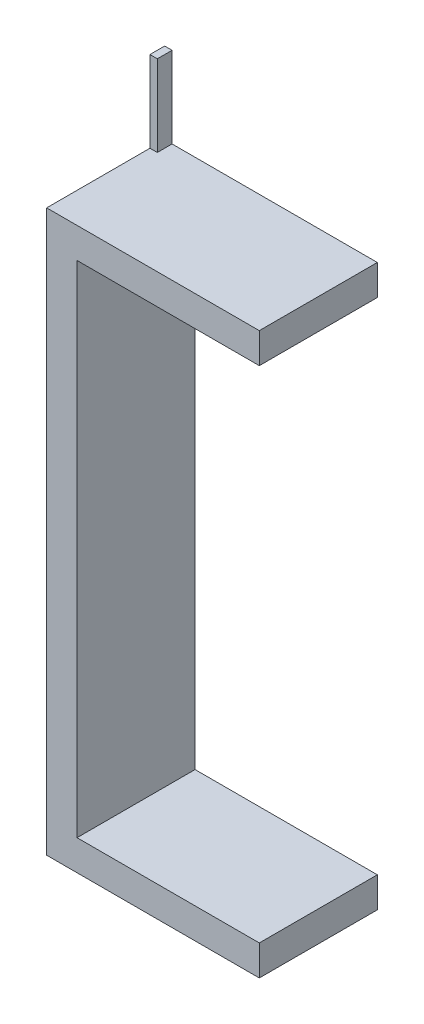
ISO-10303-21;
HEADER;
FILE_DESCRIPTION(('STEP AP214'),'2;1');
FILE_NAME('part.step','',(''),(''),'','','');
FILE_SCHEMA(('AUTOMOTIVE_DESIGN { 1 0 10303 214 1 1 1 1 }'));
ENDSEC;
DATA;
#1=APPLICATION_CONTEXT('core data for automotive mechanical design processes');
#2=APPLICATION_PROTOCOL_DEFINITION('international standard','automotive_design',2000,#1);
#3=PRODUCT_CONTEXT('',#1,'mechanical');
#4=PRODUCT('Part','Part','',(#3));
#5=PRODUCT_RELATED_PRODUCT_CATEGORY('part','',(#4));
#6=PRODUCT_DEFINITION_FORMATION('','',#4);
#7=PRODUCT_DEFINITION_CONTEXT('part definition',#1,'design');
#8=PRODUCT_DEFINITION('design','',#6,#7);
#9=PRODUCT_DEFINITION_SHAPE('','',#8);
#10=(LENGTH_UNIT() NAMED_UNIT(*) SI_UNIT(.MILLI.,.METRE.));
#11=(NAMED_UNIT(*) PLANE_ANGLE_UNIT() SI_UNIT($,.RADIAN.));
#12=(NAMED_UNIT(*) SI_UNIT($,.STERADIAN.) SOLID_ANGLE_UNIT());
#13=UNCERTAINTY_MEASURE_WITH_UNIT(LENGTH_MEASURE(1.E-05),#10,'distance_accuracy_value','');
#14=(GEOMETRIC_REPRESENTATION_CONTEXT(3) GLOBAL_UNCERTAINTY_ASSIGNED_CONTEXT((#13)) GLOBAL_UNIT_ASSIGNED_CONTEXT((#10,
#11,#12)) REPRESENTATION_CONTEXT('',''));
#15=CARTESIAN_POINT('',(0.,0.,0.));
#16=DIRECTION('',(0.,0.,1.));
#17=DIRECTION('',(1.,0.,0.));
#18=AXIS2_PLACEMENT_3D('',#15,#16,#17);
#19=CARTESIAN_POINT('',(20.5882352941176,-154.411764705882,20.0000000000003));
#20=DIRECTION('',(0.,1.,0.));
#21=DIRECTION('',(-1.,0.,0.));
#22=AXIS2_PLACEMENT_3D('',#19,#20,#21);
#23=PLANE('',#22);
#24=DIRECTION('',(1.,0.,0.));
#25=VECTOR('',#24,1.);
#26=CARTESIAN_POINT('',(20.5882352941176,-154.411764705882,-59.9999999999997));
#27=LINE('',#26,#25);
#28=CARTESIAN_POINT('',(20.5882352941176,-154.411764705882,-59.9999999999997));
#29=VERTEX_POINT('',#28);
#30=CARTESIAN_POINT('',(144.117647058824,-154.411764705882,-59.9999999999997));
#31=VERTEX_POINT('',#30);
#32=EDGE_CURVE('E139',#29,#31,#27,.T.);
#33=ORIENTED_EDGE('',*,*,#32,.F.);
#34=DIRECTION('',(0.,0.,-1.));
#35=VECTOR('',#34,1.);
#36=CARTESIAN_POINT('',(20.5882352941176,-154.411764705882,20.0000000000003));
#37=LINE('',#36,#35);
#38=CARTESIAN_POINT('',(20.5882352941176,-154.411764705882,20.0000000000003));
#39=VERTEX_POINT('',#38);
#40=EDGE_CURVE('E11',#39,#29,#37,.T.);
#41=ORIENTED_EDGE('',*,*,#40,.F.);
#42=DIRECTION('',(1.,0.,0.));
#43=VECTOR('',#42,1.);
#44=CARTESIAN_POINT('',(20.5882352941176,-154.411764705882,20.0000000000003));
#45=LINE('',#44,#43);
#46=CARTESIAN_POINT('',(144.117647058824,-154.411764705882,20.0000000000003));
#47=VERTEX_POINT('',#46);
#48=EDGE_CURVE('E148',#39,#47,#45,.T.);
#49=ORIENTED_EDGE('',*,*,#48,.T.);
#50=DIRECTION('',(0.,0.,-1.));
#51=VECTOR('',#50,1.);
#52=CARTESIAN_POINT('',(144.117647058824,-154.411764705882,20.0000000000003));
#53=LINE('',#52,#51);
#54=EDGE_CURVE('E36',#47,#31,#53,.T.);
#55=ORIENTED_EDGE('',*,*,#54,.T.);
#56=EDGE_LOOP('',(#33,#41,#49,#55));
#57=FACE_BOUND('',#56,.T.);
#58=ADVANCED_FACE('F33',(#57),#23,.T.);
#59=CARTESIAN_POINT('',(20.5882352941177,184.411764705882,20.0000000000003));
#60=DIRECTION('',(1.,0.,0.));
#61=DIRECTION('',(0.,1.,0.));
#62=AXIS2_PLACEMENT_3D('',#59,#60,#61);
#63=PLANE('',#62);
#64=DIRECTION('',(0.,-1.,0.));
#65=VECTOR('',#64,1.);
#66=CARTESIAN_POINT('',(20.5882352941177,184.411764705882,-59.9999999999997));
#67=LINE('',#66,#65);
#68=CARTESIAN_POINT('',(20.5882352941177,184.411764705882,-59.9999999999997));
#69=VERTEX_POINT('',#68);
#70=EDGE_CURVE('E152',#69,#29,#67,.T.);
#71=ORIENTED_EDGE('',*,*,#70,.F.);
#72=DIRECTION('',(0.,0.,-1.));
#73=VECTOR('',#72,1.);
#74=CARTESIAN_POINT('',(20.5882352941177,184.411764705882,20.0000000000003));
#75=LINE('',#74,#73);
#76=CARTESIAN_POINT('',(20.5882352941177,184.411764705882,20.0000000000003));
#77=VERTEX_POINT('',#76);
#78=EDGE_CURVE('E41',#77,#69,#75,.T.);
#79=ORIENTED_EDGE('',*,*,#78,.F.);
#80=DIRECTION('',(0.,-1.,0.));
#81=VECTOR('',#80,1.);
#82=CARTESIAN_POINT('',(20.5882352941177,184.411764705882,20.0000000000003));
#83=LINE('',#82,#81);
#84=EDGE_CURVE('E169',#77,#39,#83,.T.);
#85=ORIENTED_EDGE('',*,*,#84,.T.);
#86=ORIENTED_EDGE('',*,*,#40,.T.);
#87=EDGE_LOOP('',(#71,#79,#85,#86));
#88=FACE_BOUND('',#87,.T.);
#89=ADVANCED_FACE('F209',(#88),#63,.T.);
#90=CARTESIAN_POINT('',(144.117647058824,184.411764705882,20.0000000000003));
#91=DIRECTION('',(0.,-1.,0.));
#92=DIRECTION('',(0.,0.,-1.));
#93=AXIS2_PLACEMENT_3D('',#90,#91,#92);
#94=PLANE('',#93);
#95=DIRECTION('',(-1.,0.,0.));
#96=VECTOR('',#95,1.);
#97=CARTESIAN_POINT('',(144.117647058824,184.411764705882,-59.9999999999997));
#98=LINE('',#97,#96);
#99=CARTESIAN_POINT('',(144.117647058824,184.411764705882,-59.9999999999997));
#100=VERTEX_POINT('',#99);
#101=EDGE_CURVE('E183',#100,#69,#98,.T.);
#102=ORIENTED_EDGE('',*,*,#101,.F.);
#103=DIRECTION('',(0.,0.,-1.));
#104=VECTOR('',#103,1.);
#105=CARTESIAN_POINT('',(144.117647058824,184.411764705882,20.0000000000003));
#106=LINE('',#105,#104);
#107=CARTESIAN_POINT('',(144.117647058824,184.411764705882,20.0000000000003));
#108=VERTEX_POINT('',#107);
#109=EDGE_CURVE('E189',#108,#100,#106,.T.);
#110=ORIENTED_EDGE('',*,*,#109,.F.);
#111=DIRECTION('',(-1.,0.,0.));
#112=VECTOR('',#111,1.);
#113=CARTESIAN_POINT('',(144.117647058824,184.411764705882,20.0000000000003));
#114=LINE('',#113,#112);
#115=EDGE_CURVE('E166',#108,#77,#114,.T.);
#116=ORIENTED_EDGE('',*,*,#115,.T.);
#117=ORIENTED_EDGE('',*,*,#78,.T.);
#118=EDGE_LOOP('',(#102,#110,#116,#117));
#119=FACE_BOUND('',#118,.T.);
#120=ADVANCED_FACE('F236',(#119),#94,.T.);
#121=CARTESIAN_POINT('',(144.117647058824,205.,20.0000000000003));
#122=DIRECTION('',(1.,0.,0.));
#123=DIRECTION('',(0.,1.,0.));
#124=AXIS2_PLACEMENT_3D('',#121,#122,#123);
#125=PLANE('',#124);
#126=DIRECTION('',(0.,-1.,0.));
#127=VECTOR('',#126,1.);
#128=CARTESIAN_POINT('',(144.117647058824,205.,-59.9999999999997));
#129=LINE('',#128,#127);
#130=CARTESIAN_POINT('',(144.117647058824,205.,-59.9999999999997));
#131=VERTEX_POINT('',#130);
#132=EDGE_CURVE('E180',#131,#100,#129,.T.);
#133=ORIENTED_EDGE('',*,*,#132,.F.);
#134=DIRECTION('',(0.,0.,-1.));
#135=VECTOR('',#134,1.);
#136=CARTESIAN_POINT('',(144.117647058824,205.,20.0000000000003));
#137=LINE('',#136,#135);
#138=CARTESIAN_POINT('',(144.117647058824,205.,20.0000000000003));
#139=VERTEX_POINT('',#138);
#140=EDGE_CURVE('E191',#139,#131,#137,.T.);
#141=ORIENTED_EDGE('',*,*,#140,.F.);
#142=DIRECTION('',(0.,-1.,0.));
#143=VECTOR('',#142,1.);
#144=CARTESIAN_POINT('',(144.117647058824,205.,20.0000000000003));
#145=LINE('',#144,#143);
#146=EDGE_CURVE('E163',#139,#108,#145,.T.);
#147=ORIENTED_EDGE('',*,*,#146,.T.);
#148=ORIENTED_EDGE('',*,*,#109,.T.);
#149=EDGE_LOOP('',(#133,#141,#147,#148));
#150=FACE_BOUND('',#149,.T.);
#151=ADVANCED_FACE('F229',(#150),#125,.T.);
#152=CARTESIAN_POINT('',(0.,205.,20.0000000000003));
#153=DIRECTION('',(0.,1.,0.));
#154=DIRECTION('',(-1.,0.,0.));
#155=AXIS2_PLACEMENT_3D('',#152,#153,#154);
#156=PLANE('',#155);
#157=DIRECTION('',(0.,0.,-1.));
#158=VECTOR('',#157,1.);
#159=CARTESIAN_POINT('',(5.00000000000001,205.,-59.9999999999997));
#160=LINE('',#159,#158);
#161=CARTESIAN_POINT('',(5.00000000000001,205.,-49.9999999999997));
#162=VERTEX_POINT('',#161);
#163=CARTESIAN_POINT('',(5.00000000000001,205.,-59.9999999999997));
#164=VERTEX_POINT('',#163);
#165=EDGE_CURVE('E134',#162,#164,#160,.T.);
#166=ORIENTED_EDGE('',*,*,#165,.F.);
#167=DIRECTION('',(1.,0.,0.));
#168=VECTOR('',#167,1.);
#169=CARTESIAN_POINT('',(0.,205.,-49.9999999999997));
#170=LINE('',#169,#168);
#171=CARTESIAN_POINT('',(0.,205.,-49.9999999999997));
#172=VERTEX_POINT('',#171);
#173=EDGE_CURVE('E49',#172,#162,#170,.T.);
#174=ORIENTED_EDGE('',*,*,#173,.F.);
#175=DIRECTION('',(0.,0.,-1.));
#176=VECTOR('',#175,1.);
#177=CARTESIAN_POINT('',(0.,205.,20.0000000000003));
#178=LINE('',#177,#176);
#179=CARTESIAN_POINT('',(0.,205.,20.0000000000003));
#180=VERTEX_POINT('',#179);
#181=EDGE_CURVE('E138',#180,#172,#178,.T.);
#182=ORIENTED_EDGE('',*,*,#181,.F.);
#183=DIRECTION('',(1.,0.,0.));
#184=VECTOR('',#183,1.);
#185=CARTESIAN_POINT('',(0.,205.,20.0000000000003));
#186=LINE('',#185,#184);
#187=EDGE_CURVE('E160',#180,#139,#186,.T.);
#188=ORIENTED_EDGE('',*,*,#187,.T.);
#189=ORIENTED_EDGE('',*,*,#140,.T.);
#190=DIRECTION('',(1.,0.,0.));
#191=VECTOR('',#190,1.);
#192=CARTESIAN_POINT('',(0.,205.,-59.9999999999997));
#193=LINE('',#192,#191);
#194=EDGE_CURVE('E55',#164,#131,#193,.T.);
#195=ORIENTED_EDGE('',*,*,#194,.F.);
#196=EDGE_LOOP('',(#166,#174,#182,#188,#189,#195));
#197=FACE_BOUND('',#196,.T.);
#198=ADVANCED_FACE('F227',(#197),#156,.T.);
#199=CARTESIAN_POINT('',(0.,-175.,20.0000000000003));
#200=DIRECTION('',(-1.,0.,0.));
#201=DIRECTION('',(0.,0.,1.));
#202=AXIS2_PLACEMENT_3D('',#199,#200,#201);
#203=PLANE('',#202);
#204=DIRECTION('',(0.,1.,0.));
#205=VECTOR('',#204,1.);
#206=CARTESIAN_POINT('',(0.,-175.,-59.9999999999997));
#207=LINE('',#206,#205);
#208=CARTESIAN_POINT('',(0.,-175.,-59.9999999999997));
#209=VERTEX_POINT('',#208);
#210=CARTESIAN_POINT('',(0.,260.,-59.9999999999997));
#211=VERTEX_POINT('',#210);
#212=EDGE_CURVE('E177',#209,#211,#207,.T.);
#213=ORIENTED_EDGE('',*,*,#212,.F.);
#214=DIRECTION('',(0.,0.,-1.));
#215=VECTOR('',#214,1.);
#216=CARTESIAN_POINT('',(0.,-175.,20.0000000000003));
#217=LINE('',#216,#215);
#218=CARTESIAN_POINT('',(0.,-175.,20.0000000000003));
#219=VERTEX_POINT('',#218);
#220=EDGE_CURVE('E194',#219,#209,#217,.T.);
#221=ORIENTED_EDGE('',*,*,#220,.F.);
#222=DIRECTION('',(0.,1.,0.));
#223=VECTOR('',#222,1.);
#224=CARTESIAN_POINT('',(0.,-175.,20.0000000000003));
#225=LINE('',#224,#223);
#226=EDGE_CURVE('E158',#219,#180,#225,.T.);
#227=ORIENTED_EDGE('',*,*,#226,.T.);
#228=ORIENTED_EDGE('',*,*,#181,.T.);
#229=DIRECTION('',(0.,-1.,0.));
#230=VECTOR('',#229,1.);
#231=CARTESIAN_POINT('',(0.,260.,-49.9999999999997));
#232=LINE('',#231,#230);
#233=CARTESIAN_POINT('',(0.,260.,-49.9999999999997));
#234=VERTEX_POINT('',#233);
#235=EDGE_CURVE('E119',#234,#172,#232,.T.);
#236=ORIENTED_EDGE('',*,*,#235,.F.);
#237=DIRECTION('',(0.,0.,1.));
#238=VECTOR('',#237,1.);
#239=CARTESIAN_POINT('',(0.,260.,-59.9999999999997));
#240=LINE('',#239,#238);
#241=EDGE_CURVE('E125',#211,#234,#240,.T.);
#242=ORIENTED_EDGE('',*,*,#241,.F.);
#243=EDGE_LOOP('',(#213,#221,#227,#228,#236,#242));
#244=FACE_BOUND('',#243,.T.);
#245=ADVANCED_FACE('F136',(#244),#203,.T.);
#246=CARTESIAN_POINT('',(144.117647058824,-175.,20.0000000000003));
#247=DIRECTION('',(0.,-1.,0.));
#248=DIRECTION('',(1.,0.,0.));
#249=AXIS2_PLACEMENT_3D('',#246,#247,#248);
#250=PLANE('',#249);
#251=DIRECTION('',(-1.,0.,0.));
#252=VECTOR('',#251,1.);
#253=CARTESIAN_POINT('',(144.117647058824,-175.,-59.9999999999997));
#254=LINE('',#253,#252);
#255=CARTESIAN_POINT('',(144.117647058824,-175.,-59.9999999999997));
#256=VERTEX_POINT('',#255);
#257=EDGE_CURVE('E174',#256,#209,#254,.T.);
#258=ORIENTED_EDGE('',*,*,#257,.F.);
#259=DIRECTION('',(0.,0.,-1.));
#260=VECTOR('',#259,1.);
#261=CARTESIAN_POINT('',(144.117647058824,-175.,20.0000000000003));
#262=LINE('',#261,#260);
#263=CARTESIAN_POINT('',(144.117647058824,-175.,20.0000000000003));
#264=VERTEX_POINT('',#263);
#265=EDGE_CURVE('E195',#264,#256,#262,.T.);
#266=ORIENTED_EDGE('',*,*,#265,.F.);
#267=DIRECTION('',(-1.,0.,0.));
#268=VECTOR('',#267,1.);
#269=CARTESIAN_POINT('',(144.117647058824,-175.,20.0000000000003));
#270=LINE('',#269,#268);
#271=EDGE_CURVE('E155',#264,#219,#270,.T.);
#272=ORIENTED_EDGE('',*,*,#271,.T.);
#273=ORIENTED_EDGE('',*,*,#220,.T.);
#274=EDGE_LOOP('',(#258,#266,#272,#273));
#275=FACE_BOUND('',#274,.T.);
#276=ADVANCED_FACE('F218',(#275),#250,.T.);
#277=CARTESIAN_POINT('',(144.117647058824,-154.411764705882,20.0000000000003));
#278=DIRECTION('',(1.,0.,0.));
#279=DIRECTION('',(0.,0.,-1.));
#280=AXIS2_PLACEMENT_3D('',#277,#278,#279);
#281=PLANE('',#280);
#282=DIRECTION('',(0.,-1.,0.));
#283=VECTOR('',#282,1.);
#284=CARTESIAN_POINT('',(144.117647058824,-154.411764705882,-59.9999999999997));
#285=LINE('',#284,#283);
#286=EDGE_CURVE('E142',#31,#256,#285,.T.);
#287=ORIENTED_EDGE('',*,*,#286,.F.);
#288=ORIENTED_EDGE('',*,*,#54,.F.);
#289=DIRECTION('',(0.,-1.,0.));
#290=VECTOR('',#289,1.);
#291=CARTESIAN_POINT('',(144.117647058824,-154.411764705882,20.0000000000003));
#292=LINE('',#291,#290);
#293=EDGE_CURVE('E151',#47,#264,#292,.T.);
#294=ORIENTED_EDGE('',*,*,#293,.T.);
#295=ORIENTED_EDGE('',*,*,#265,.T.);
#296=EDGE_LOOP('',(#287,#288,#294,#295));
#297=FACE_BOUND('',#296,.T.);
#298=ADVANCED_FACE('F203',(#297),#281,.T.);
#299=CARTESIAN_POINT('',(0.,0.,20.0000000000003));
#300=DIRECTION('',(0.,0.,-1.));
#301=DIRECTION('',(-1.,0.,0.));
#302=AXIS2_PLACEMENT_3D('',#299,#300,#301);
#303=PLANE('',#302);
#304=ORIENTED_EDGE('',*,*,#48,.F.);
#305=ORIENTED_EDGE('',*,*,#84,.F.);
#306=ORIENTED_EDGE('',*,*,#115,.F.);
#307=ORIENTED_EDGE('',*,*,#146,.F.);
#308=ORIENTED_EDGE('',*,*,#187,.F.);
#309=ORIENTED_EDGE('',*,*,#226,.F.);
#310=ORIENTED_EDGE('',*,*,#271,.F.);
#311=ORIENTED_EDGE('',*,*,#293,.F.);
#312=EDGE_LOOP('',(#304,#305,#306,#307,#308,#309,#310,#311));
#313=FACE_BOUND('',#312,.T.);
#314=ADVANCED_FACE('F212',(#313),#303,.F.);
#315=CARTESIAN_POINT('',(0.,0.,-59.9999999999997));
#316=DIRECTION('',(0.,0.,-1.));
#317=DIRECTION('',(-1.,0.,0.));
#318=AXIS2_PLACEMENT_3D('',#315,#316,#317);
#319=PLANE('',#318);
#320=ORIENTED_EDGE('',*,*,#32,.T.);
#321=ORIENTED_EDGE('',*,*,#286,.T.);
#322=ORIENTED_EDGE('',*,*,#257,.T.);
#323=ORIENTED_EDGE('',*,*,#212,.T.);
#324=DIRECTION('',(-1.,0.,0.));
#325=VECTOR('',#324,1.);
#326=CARTESIAN_POINT('',(0.,260.,-59.9999999999997));
#327=LINE('',#326,#325);
#328=CARTESIAN_POINT('',(5.00000000000002,260.,-59.9999999999997));
#329=VERTEX_POINT('',#328);
#330=EDGE_CURVE('E131',#329,#211,#327,.T.);
#331=ORIENTED_EDGE('',*,*,#330,.F.);
#332=DIRECTION('',(0.,-1.,0.));
#333=VECTOR('',#332,1.);
#334=CARTESIAN_POINT('',(5.00000000000002,260.,-59.9999999999997));
#335=LINE('',#334,#333);
#336=EDGE_CURVE('E144',#329,#164,#335,.T.);
#337=ORIENTED_EDGE('',*,*,#336,.T.);
#338=ORIENTED_EDGE('',*,*,#194,.T.);
#339=ORIENTED_EDGE('',*,*,#132,.T.);
#340=ORIENTED_EDGE('',*,*,#101,.T.);
#341=ORIENTED_EDGE('',*,*,#70,.T.);
#342=EDGE_LOOP('',(#320,#321,#322,#323,#331,#337,#338,#339,#340,#341));
#343=FACE_BOUND('',#342,.T.);
#344=ADVANCED_FACE('F205',(#343),#319,.T.);
#345=CARTESIAN_POINT('',(0.,260.,-49.9999999999997));
#346=DIRECTION('',(0.,0.,-1.));
#347=DIRECTION('',(-1.,0.,0.));
#348=AXIS2_PLACEMENT_3D('',#345,#346,#347);
#349=PLANE('',#348);
#350=ORIENTED_EDGE('',*,*,#173,.T.);
#351=DIRECTION('',(0.,-1.,0.));
#352=VECTOR('',#351,1.);
#353=CARTESIAN_POINT('',(5.00000000000002,260.,-49.9999999999997));
#354=LINE('',#353,#352);
#355=CARTESIAN_POINT('',(5.00000000000002,260.,-49.9999999999997));
#356=VERTEX_POINT('',#355);
#357=EDGE_CURVE('E121',#356,#162,#354,.T.);
#358=ORIENTED_EDGE('',*,*,#357,.F.);
#359=DIRECTION('',(1.,0.,0.));
#360=VECTOR('',#359,1.);
#361=CARTESIAN_POINT('',(0.,260.,-49.9999999999997));
#362=LINE('',#361,#360);
#363=EDGE_CURVE('E115',#234,#356,#362,.T.);
#364=ORIENTED_EDGE('',*,*,#363,.F.);
#365=ORIENTED_EDGE('',*,*,#235,.T.);
#366=EDGE_LOOP('',(#350,#358,#364,#365));
#367=FACE_BOUND('',#366,.T.);
#368=ADVANCED_FACE('F117',(#367),#349,.F.);
#369=CARTESIAN_POINT('',(5.00000000000002,260.,-59.9999999999997));
#370=DIRECTION('',(-1.,0.,0.));
#371=DIRECTION('',(0.,-1.,0.));
#372=AXIS2_PLACEMENT_3D('',#369,#370,#371);
#373=PLANE('',#372);
#374=ORIENTED_EDGE('',*,*,#165,.T.);
#375=ORIENTED_EDGE('',*,*,#336,.F.);
#376=DIRECTION('',(0.,0.,-1.));
#377=VECTOR('',#376,1.);
#378=CARTESIAN_POINT('',(5.00000000000002,260.,-59.9999999999997));
#379=LINE('',#378,#377);
#380=EDGE_CURVE('E124',#356,#329,#379,.T.);
#381=ORIENTED_EDGE('',*,*,#380,.F.);
#382=ORIENTED_EDGE('',*,*,#357,.T.);
#383=EDGE_LOOP('',(#374,#375,#381,#382));
#384=FACE_BOUND('',#383,.T.);
#385=ADVANCED_FACE('F226',(#384),#373,.F.);
#386=CARTESIAN_POINT('',(0.,260.,0.));
#387=DIRECTION('',(0.,1.,0.));
#388=DIRECTION('',(0.,0.,1.));
#389=AXIS2_PLACEMENT_3D('',#386,#387,#388);
#390=PLANE('',#389);
#391=ORIENTED_EDGE('',*,*,#241,.T.);
#392=ORIENTED_EDGE('',*,*,#363,.T.);
#393=ORIENTED_EDGE('',*,*,#380,.T.);
#394=ORIENTED_EDGE('',*,*,#330,.T.);
#395=EDGE_LOOP('',(#391,#392,#393,#394));
#396=FACE_BOUND('',#395,.T.);
#397=ADVANCED_FACE('F129',(#396),#390,.T.);
#398=CLOSED_SHELL('',(#58,#89,#120,#151,#198,#245,#276,#298,#314,#344,#368,#385,#397));
#399=MANIFOLD_SOLID_BREP('B2',#398);
#400=ADVANCED_BREP_SHAPE_REPRESENTATION('',(#18,#399),#14);
#401=SHAPE_DEFINITION_REPRESENTATION(#9,#400);
ENDSEC;
END-ISO-10303-21;
